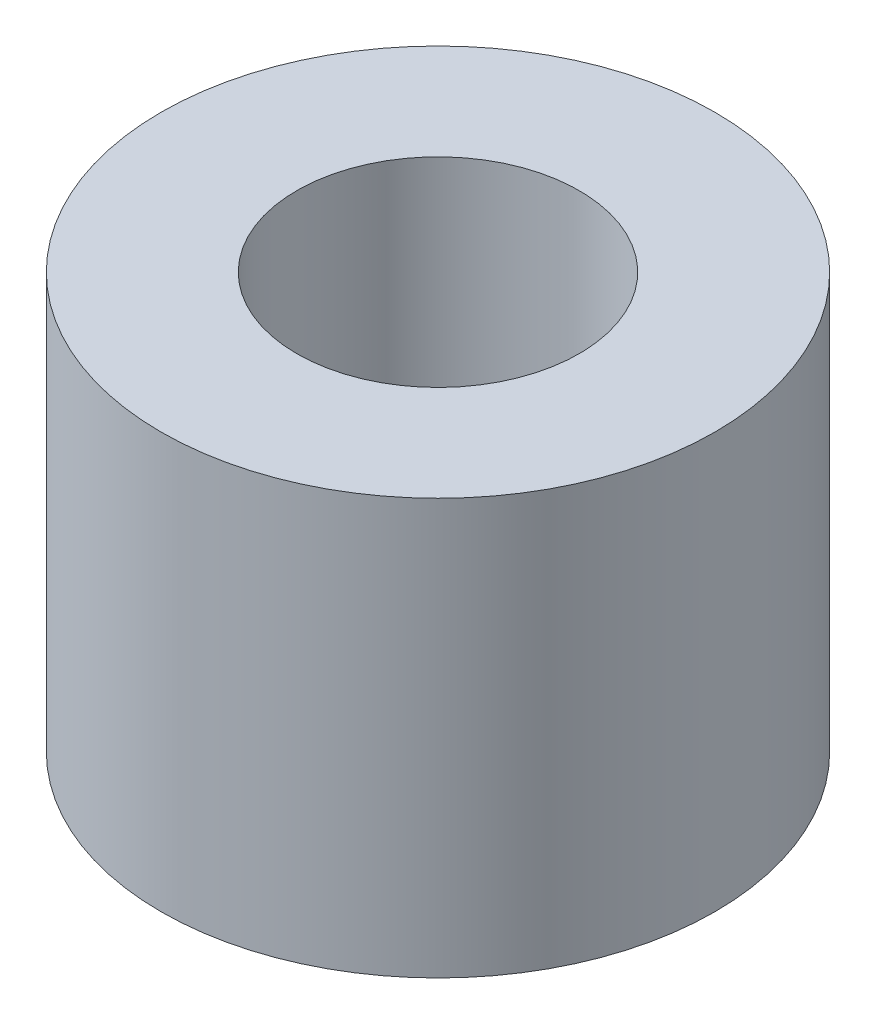
ISO-10303-21;
HEADER;
FILE_DESCRIPTION(('STEP AP214'),'2;1');
FILE_NAME('part.step','',(''),(''),'','','');
FILE_SCHEMA(('AUTOMOTIVE_DESIGN { 1 0 10303 214 1 1 1 1 }'));
ENDSEC;
DATA;
#1=APPLICATION_CONTEXT('core data for automotive mechanical design processes');
#2=APPLICATION_PROTOCOL_DEFINITION('international standard','automotive_design',2000,#1);
#3=PRODUCT_CONTEXT('',#1,'mechanical');
#4=PRODUCT('Part','Part','',(#3));
#5=PRODUCT_RELATED_PRODUCT_CATEGORY('part','',(#4));
#6=PRODUCT_DEFINITION_FORMATION('','',#4);
#7=PRODUCT_DEFINITION_CONTEXT('part definition',#1,'design');
#8=PRODUCT_DEFINITION('design','',#6,#7);
#9=PRODUCT_DEFINITION_SHAPE('','',#8);
#10=(LENGTH_UNIT() NAMED_UNIT(*) SI_UNIT(.MILLI.,.METRE.));
#11=(NAMED_UNIT(*) PLANE_ANGLE_UNIT() SI_UNIT($,.RADIAN.));
#12=(NAMED_UNIT(*) SI_UNIT($,.STERADIAN.) SOLID_ANGLE_UNIT());
#13=UNCERTAINTY_MEASURE_WITH_UNIT(LENGTH_MEASURE(1.E-05),#10,'distance_accuracy_value','');
#14=(GEOMETRIC_REPRESENTATION_CONTEXT(3) GLOBAL_UNCERTAINTY_ASSIGNED_CONTEXT((#13)) GLOBAL_UNIT_ASSIGNED_CONTEXT((#10,
#11,#12)) REPRESENTATION_CONTEXT('',''));
#15=CARTESIAN_POINT('',(0.,0.,0.));
#16=DIRECTION('',(0.,0.,1.));
#17=DIRECTION('',(1.,0.,0.));
#18=AXIS2_PLACEMENT_3D('',#15,#16,#17);
#19=CARTESIAN_POINT('',(0.,15.,0.));
#20=DIRECTION('',(0.,-1.,0.));
#21=DIRECTION('',(0.,0.,-1.));
#22=AXIS2_PLACEMENT_3D('',#19,#20,#21);
#23=CYLINDRICAL_SURFACE('',#22,10.);
#24=CARTESIAN_POINT('',(0.,15.,0.));
#25=DIRECTION('',(0.,1.,0.));
#26=DIRECTION('',(0.,0.,1.));
#27=AXIS2_PLACEMENT_3D('',#24,#25,#26);
#28=CIRCLE('',#27,10.);
#29=CARTESIAN_POINT('',(0.,15.,10.));
#30=VERTEX_POINT('',#29);
#31=EDGE_CURVE('E11',#30,#30,#28,.T.);
#32=ORIENTED_EDGE('',*,*,#31,.F.);
#33=EDGE_LOOP('',(#32));
#34=FACE_BOUND('',#33,.T.);
#35=CARTESIAN_POINT('',(0.,0.,0.));
#36=DIRECTION('',(0.,1.,0.));
#37=DIRECTION('',(0.,0.,1.));
#38=AXIS2_PLACEMENT_3D('',#35,#36,#37);
#39=CIRCLE('',#38,10.);
#40=CARTESIAN_POINT('',(0.,0.,10.));
#41=VERTEX_POINT('',#40);
#42=EDGE_CURVE('E42',#41,#41,#39,.T.);
#43=ORIENTED_EDGE('',*,*,#42,.T.);
#44=EDGE_LOOP('',(#43));
#45=FACE_BOUND('',#44,.T.);
#46=ADVANCED_FACE('F39',(#34,#45),#23,.T.);
#47=CARTESIAN_POINT('',(0.,15.,0.));
#48=DIRECTION('',(0.,1.,0.));
#49=DIRECTION('',(0.,0.,1.));
#50=AXIS2_PLACEMENT_3D('',#47,#48,#49);
#51=PLANE('',#50);
#52=CARTESIAN_POINT('',(0.,15.,0.));
#53=DIRECTION('',(0.,1.,0.));
#54=DIRECTION('',(0.,0.,1.));
#55=AXIS2_PLACEMENT_3D('',#52,#53,#54);
#56=CIRCLE('',#55,5.1);
#57=CARTESIAN_POINT('',(0.,15.,5.1));
#58=VERTEX_POINT('',#57);
#59=EDGE_CURVE('E58',#58,#58,#56,.T.);
#60=ORIENTED_EDGE('',*,*,#59,.F.);
#61=EDGE_LOOP('',(#60));
#62=FACE_BOUND('',#61,.T.);
#63=ORIENTED_EDGE('',*,*,#31,.T.);
#64=EDGE_LOOP('',(#63));
#65=FACE_BOUND('',#64,.T.);
#66=ADVANCED_FACE('F66',(#62,#65),#51,.T.);
#67=CARTESIAN_POINT('',(0.,0.,0.));
#68=DIRECTION('',(0.,1.,0.));
#69=DIRECTION('',(0.,0.,1.));
#70=AXIS2_PLACEMENT_3D('',#67,#68,#69);
#71=PLANE('',#70);
#72=ORIENTED_EDGE('',*,*,#42,.F.);
#73=EDGE_LOOP('',(#72));
#74=FACE_BOUND('',#73,.T.);
#75=ADVANCED_FACE('F52',(#74),#71,.F.);
#76=CARTESIAN_POINT('',(0.,5.,0.));
#77=DIRECTION('',(0.,1.,0.));
#78=DIRECTION('',(0.,0.,1.));
#79=AXIS2_PLACEMENT_3D('',#76,#77,#78);
#80=CONICAL_SURFACE('',#79,5.1,1.02974425867665);
#81=CARTESIAN_POINT('',(0.,1.93561084295944,0.));
#82=VERTEX_POINT('',#81);
#83=VERTEX_LOOP('',#82);
#84=FACE_BOUND('',#83,.T.);
#85=CARTESIAN_POINT('',(0.,5.,0.));
#86=DIRECTION('',(0.,1.,0.));
#87=DIRECTION('',(0.,0.,1.));
#88=AXIS2_PLACEMENT_3D('',#85,#86,#87);
#89=CIRCLE('',#88,5.1);
#90=CARTESIAN_POINT('',(0.,5.,5.1));
#91=VERTEX_POINT('',#90);
#92=EDGE_CURVE('E56',#91,#91,#89,.T.);
#93=ORIENTED_EDGE('',*,*,#92,.T.);
#94=EDGE_LOOP('',(#93));
#95=FACE_BOUND('',#94,.T.);
#96=ADVANCED_FACE('F48',(#84,#95),#80,.F.);
#97=CARTESIAN_POINT('',(0.,15.,0.));
#98=DIRECTION('',(0.,1.,0.));
#99=DIRECTION('',(0.,0.,1.));
#100=AXIS2_PLACEMENT_3D('',#97,#98,#99);
#101=CYLINDRICAL_SURFACE('',#100,5.1);
#102=ORIENTED_EDGE('',*,*,#92,.F.);
#103=EDGE_LOOP('',(#102));
#104=FACE_BOUND('',#103,.T.);
#105=ORIENTED_EDGE('',*,*,#59,.T.);
#106=EDGE_LOOP('',(#105));
#107=FACE_BOUND('',#106,.T.);
#108=ADVANCED_FACE('F51',(#104,#107),#101,.F.);
#109=CLOSED_SHELL('',(#46,#66,#75,#96,#108));
#110=MANIFOLD_SOLID_BREP('B2',#109);
#111=ADVANCED_BREP_SHAPE_REPRESENTATION('',(#18,#110),#14);
#112=SHAPE_DEFINITION_REPRESENTATION(#9,#111);
ENDSEC;
END-ISO-10303-21;
